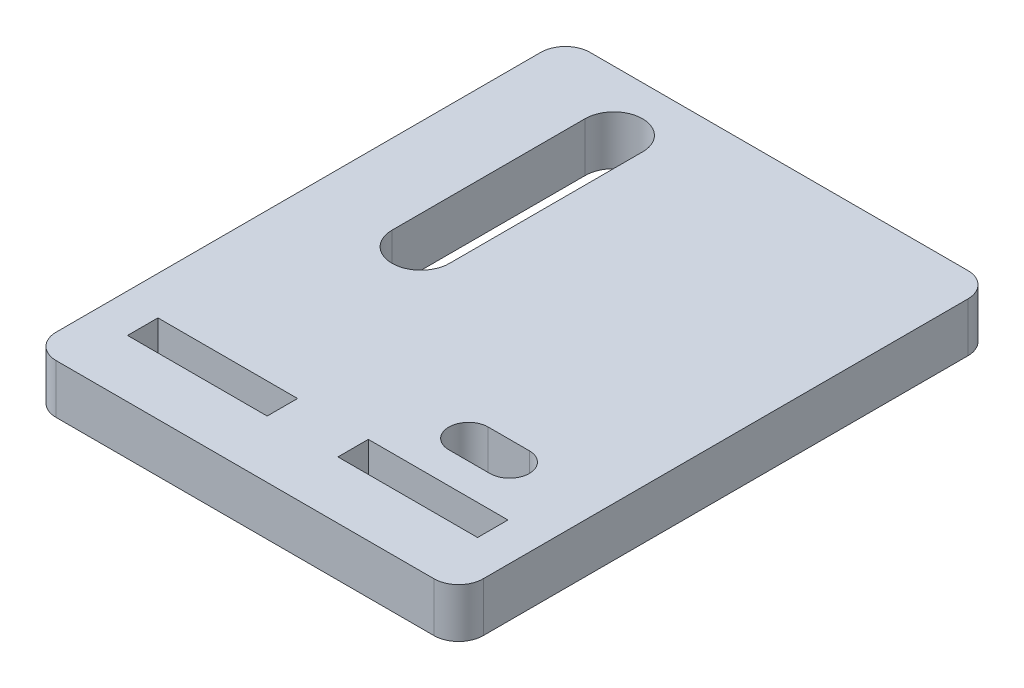
ISO-10303-21;
HEADER;
FILE_DESCRIPTION(('STEP AP214'),'2;1');
FILE_NAME('part.step','',(''),(''),'','','');
FILE_SCHEMA(('AUTOMOTIVE_DESIGN { 1 0 10303 214 1 1 1 1 }'));
ENDSEC;
DATA;
#1=APPLICATION_CONTEXT('core data for automotive mechanical design processes');
#2=APPLICATION_PROTOCOL_DEFINITION('international standard','automotive_design',2000,#1);
#3=PRODUCT_CONTEXT('',#1,'mechanical');
#4=PRODUCT('Part','Part','',(#3));
#5=PRODUCT_RELATED_PRODUCT_CATEGORY('part','',(#4));
#6=PRODUCT_DEFINITION_FORMATION('','',#4);
#7=PRODUCT_DEFINITION_CONTEXT('part definition',#1,'design');
#8=PRODUCT_DEFINITION('design','',#6,#7);
#9=PRODUCT_DEFINITION_SHAPE('','',#8);
#10=(LENGTH_UNIT() NAMED_UNIT(*) SI_UNIT(.MILLI.,.METRE.));
#11=(NAMED_UNIT(*) PLANE_ANGLE_UNIT() SI_UNIT($,.RADIAN.));
#12=(NAMED_UNIT(*) SI_UNIT($,.STERADIAN.) SOLID_ANGLE_UNIT());
#13=UNCERTAINTY_MEASURE_WITH_UNIT(LENGTH_MEASURE(1.E-05),#10,'distance_accuracy_value','');
#14=(GEOMETRIC_REPRESENTATION_CONTEXT(3) GLOBAL_UNCERTAINTY_ASSIGNED_CONTEXT((#13)) GLOBAL_UNIT_ASSIGNED_CONTEXT((#10,
#11,#12)) REPRESENTATION_CONTEXT('',''));
#15=CARTESIAN_POINT('',(0.,0.,0.));
#16=DIRECTION('',(0.,0.,1.));
#17=DIRECTION('',(1.,0.,0.));
#18=AXIS2_PLACEMENT_3D('',#15,#16,#17);
#19=CARTESIAN_POINT('',(0.,6.,0.));
#20=DIRECTION('',(0.,-1.,0.));
#21=DIRECTION('',(0.,0.,-1.));
#22=AXIS2_PLACEMENT_3D('',#19,#20,#21);
#23=PLANE('',#22);
#24=DIRECTION('',(0.,0.,1.));
#25=VECTOR('',#24,1.);
#26=CARTESIAN_POINT('',(-16.3077715235031,6.,-25.2));
#27=LINE('',#26,#25);
#28=CARTESIAN_POINT('',(-16.3077715235031,6.,-25.2));
#29=VERTEX_POINT('',#28);
#30=CARTESIAN_POINT('',(-16.307771523503,6.,-1.7));
#31=VERTEX_POINT('',#30);
#32=EDGE_CURVE('E220',#29,#31,#27,.T.);
#33=ORIENTED_EDGE('',*,*,#32,.F.);
#34=CARTESIAN_POINT('',(-12.8077715235031,6.,-25.2));
#35=DIRECTION('',(0.,1.,0.));
#36=DIRECTION('',(0.,0.,1.));
#37=AXIS2_PLACEMENT_3D('',#34,#35,#36);
#38=CIRCLE('',#37,3.5);
#39=CARTESIAN_POINT('',(-9.30777152350306,6.,-25.2));
#40=VERTEX_POINT('',#39);
#41=EDGE_CURVE('E48',#40,#29,#38,.T.);
#42=ORIENTED_EDGE('',*,*,#41,.F.);
#43=DIRECTION('',(0.,0.,-1.));
#44=VECTOR('',#43,1.);
#45=CARTESIAN_POINT('',(-9.30777152350306,6.,-25.2));
#46=LINE('',#45,#44);
#47=CARTESIAN_POINT('',(-9.30777152350305,6.,-1.7));
#48=VERTEX_POINT('',#47);
#49=EDGE_CURVE('E211',#48,#40,#46,.T.);
#50=ORIENTED_EDGE('',*,*,#49,.F.);
#51=CARTESIAN_POINT('',(-12.8077715235031,6.,-1.7));
#52=DIRECTION('',(0.,1.,0.));
#53=DIRECTION('',(0.,0.,1.));
#54=AXIS2_PLACEMENT_3D('',#51,#52,#53);
#55=CIRCLE('',#54,3.5);
#56=EDGE_CURVE('E214',#31,#48,#55,.T.);
#57=ORIENTED_EDGE('',*,*,#56,.F.);
#58=EDGE_LOOP('',(#33,#42,#50,#57));
#59=FACE_BOUND('',#58,.T.);
#60=DIRECTION('',(1.,0.,0.));
#61=VECTOR('',#60,1.);
#62=CARTESIAN_POINT('',(10.307771523503,6.,18.));
#63=LINE('',#62,#61);
#64=CARTESIAN_POINT('',(10.307771523503,6.,18.));
#65=VERTEX_POINT('',#64);
#66=CARTESIAN_POINT('',(15.3077715235031,6.,18.));
#67=VERTEX_POINT('',#66);
#68=EDGE_CURVE('E245',#65,#67,#63,.T.);
#69=ORIENTED_EDGE('',*,*,#68,.F.);
#70=CARTESIAN_POINT('',(10.307771523503,6.,15.6));
#71=DIRECTION('',(0.,1.,0.));
#72=DIRECTION('',(0.,0.,1.));
#73=AXIS2_PLACEMENT_3D('',#70,#71,#72);
#74=CIRCLE('',#73,2.39999999999999);
#75=CARTESIAN_POINT('',(10.307771523503,6.,13.2));
#76=VERTEX_POINT('',#75);
#77=EDGE_CURVE('E226',#76,#65,#74,.T.);
#78=ORIENTED_EDGE('',*,*,#77,.F.);
#79=DIRECTION('',(-1.,0.,0.));
#80=VECTOR('',#79,1.);
#81=CARTESIAN_POINT('',(10.307771523503,6.,13.2));
#82=LINE('',#81,#80);
#83=CARTESIAN_POINT('',(15.307771523503,6.,13.2));
#84=VERTEX_POINT('',#83);
#85=EDGE_CURVE('E234',#84,#76,#82,.T.);
#86=ORIENTED_EDGE('',*,*,#85,.F.);
#87=CARTESIAN_POINT('',(15.307771523503,6.,15.6));
#88=DIRECTION('',(0.,1.,0.));
#89=DIRECTION('',(0.,0.,1.));
#90=AXIS2_PLACEMENT_3D('',#87,#88,#89);
#91=CIRCLE('',#90,2.39999999999999);
#92=EDGE_CURVE('E248',#67,#84,#91,.T.);
#93=ORIENTED_EDGE('',*,*,#92,.F.);
#94=EDGE_LOOP('',(#69,#78,#86,#93));
#95=FACE_BOUND('',#94,.T.);
#96=DIRECTION('',(-1.,0.,0.));
#97=VECTOR('',#96,1.);
#98=CARTESIAN_POINT('',(-26.,6.,-32.5));
#99=LINE('',#98,#97);
#100=CARTESIAN_POINT('',(23.,6.,-32.5));
#101=VERTEX_POINT('',#100);
#102=CARTESIAN_POINT('',(-23.,6.,-32.5));
#103=VERTEX_POINT('',#102);
#104=EDGE_CURVE('E328',#101,#103,#99,.T.);
#105=ORIENTED_EDGE('',*,*,#104,.T.);
#106=CARTESIAN_POINT('',(-23.,6.,-29.5));
#107=DIRECTION('',(0.,-1.,0.));
#108=DIRECTION('',(0.,0.,-1.));
#109=AXIS2_PLACEMENT_3D('',#106,#107,#108);
#110=CIRCLE('',#109,3.);
#111=CARTESIAN_POINT('',(-26.,6.,-29.5));
#112=VERTEX_POINT('',#111);
#113=EDGE_CURVE('E372',#103,#112,#110,.F.);
#114=ORIENTED_EDGE('',*,*,#113,.T.);
#115=DIRECTION('',(0.,0.,1.));
#116=VECTOR('',#115,1.);
#117=CARTESIAN_POINT('',(-26.,6.,32.5));
#118=LINE('',#117,#116);
#119=CARTESIAN_POINT('',(-26.,6.,29.5));
#120=VERTEX_POINT('',#119);
#121=EDGE_CURVE('E332',#112,#120,#118,.T.);
#122=ORIENTED_EDGE('',*,*,#121,.T.);
#123=CARTESIAN_POINT('',(-23.,6.,29.5));
#124=DIRECTION('',(0.,-1.,0.));
#125=DIRECTION('',(0.,0.,-1.));
#126=AXIS2_PLACEMENT_3D('',#123,#124,#125);
#127=CIRCLE('',#126,3.);
#128=CARTESIAN_POINT('',(-23.,6.,32.5));
#129=VERTEX_POINT('',#128);
#130=EDGE_CURVE('E366',#120,#129,#127,.F.);
#131=ORIENTED_EDGE('',*,*,#130,.T.);
#132=DIRECTION('',(1.,0.,0.));
#133=VECTOR('',#132,1.);
#134=CARTESIAN_POINT('',(-26.,6.,32.5));
#135=LINE('',#134,#133);
#136=CARTESIAN_POINT('',(23.,6.,32.5));
#137=VERTEX_POINT('',#136);
#138=EDGE_CURVE('E335',#129,#137,#135,.T.);
#139=ORIENTED_EDGE('',*,*,#138,.T.);
#140=CARTESIAN_POINT('',(23.,6.,29.5));
#141=DIRECTION('',(0.,-1.,0.));
#142=DIRECTION('',(0.,0.,-1.));
#143=AXIS2_PLACEMENT_3D('',#140,#141,#142);
#144=CIRCLE('',#143,3.);
#145=CARTESIAN_POINT('',(26.,6.,29.5));
#146=VERTEX_POINT('',#145);
#147=EDGE_CURVE('E370',#137,#146,#144,.F.);
#148=ORIENTED_EDGE('',*,*,#147,.T.);
#149=DIRECTION('',(0.,0.,-1.));
#150=VECTOR('',#149,1.);
#151=CARTESIAN_POINT('',(26.,6.,32.5));
#152=LINE('',#151,#150);
#153=CARTESIAN_POINT('',(26.,6.,-29.5));
#154=VERTEX_POINT('',#153);
#155=EDGE_CURVE('E325',#146,#154,#152,.T.);
#156=ORIENTED_EDGE('',*,*,#155,.T.);
#157=CARTESIAN_POINT('',(23.,6.,-29.5));
#158=DIRECTION('',(0.,-1.,0.));
#159=DIRECTION('',(0.,0.,-1.));
#160=AXIS2_PLACEMENT_3D('',#157,#158,#159);
#161=CIRCLE('',#160,3.);
#162=EDGE_CURVE('E368',#154,#101,#161,.F.);
#163=ORIENTED_EDGE('',*,*,#162,.T.);
#164=EDGE_LOOP('',(#105,#114,#122,#131,#139,#148,#156,#163));
#165=FACE_BOUND('',#164,.T.);
#166=DIRECTION('',(-1.,0.,0.));
#167=VECTOR('',#166,1.);
#168=CARTESIAN_POINT('',(-21.307771523503,6.,21.8));
#169=LINE('',#168,#167);
#170=CARTESIAN_POINT('',(-4.30777152350305,6.,21.8));
#171=VERTEX_POINT('',#170);
#172=CARTESIAN_POINT('',(-21.307771523503,6.,21.8));
#173=VERTEX_POINT('',#172);
#174=EDGE_CURVE('E308',#171,#173,#169,.T.);
#175=ORIENTED_EDGE('',*,*,#174,.F.);
#176=DIRECTION('',(0.,0.,-1.));
#177=VECTOR('',#176,1.);
#178=CARTESIAN_POINT('',(-4.30777152350305,6.,25.5));
#179=LINE('',#178,#177);
#180=CARTESIAN_POINT('',(-4.30777152350305,6.,25.5));
#181=VERTEX_POINT('',#180);
#182=EDGE_CURVE('E286',#181,#171,#179,.T.);
#183=ORIENTED_EDGE('',*,*,#182,.F.);
#184=DIRECTION('',(1.,0.,0.));
#185=VECTOR('',#184,1.);
#186=CARTESIAN_POINT('',(-21.307771523503,6.,25.5));
#187=LINE('',#186,#185);
#188=CARTESIAN_POINT('',(-21.307771523503,6.,25.5));
#189=VERTEX_POINT('',#188);
#190=EDGE_CURVE('E297',#189,#181,#187,.T.);
#191=ORIENTED_EDGE('',*,*,#190,.F.);
#192=DIRECTION('',(0.,0.,1.));
#193=VECTOR('',#192,1.);
#194=CARTESIAN_POINT('',(-21.307771523503,6.,25.5));
#195=LINE('',#194,#193);
#196=EDGE_CURVE('E311',#173,#189,#195,.T.);
#197=ORIENTED_EDGE('',*,*,#196,.F.);
#198=EDGE_LOOP('',(#175,#183,#191,#197));
#199=FACE_BOUND('',#198,.T.);
#200=DIRECTION('',(0.,0.,-1.));
#201=VECTOR('',#200,1.);
#202=CARTESIAN_POINT('',(4.30777152350305,6.,25.5));
#203=LINE('',#202,#201);
#204=CARTESIAN_POINT('',(4.30777152350305,6.,25.5));
#205=VERTEX_POINT('',#204);
#206=CARTESIAN_POINT('',(4.30777152350305,6.,21.8));
#207=VERTEX_POINT('',#206);
#208=EDGE_CURVE('E255',#205,#207,#203,.T.);
#209=ORIENTED_EDGE('',*,*,#208,.T.);
#210=DIRECTION('',(1.,0.,0.));
#211=VECTOR('',#210,1.);
#212=CARTESIAN_POINT('',(21.307771523503,6.,21.8));
#213=LINE('',#212,#211);
#214=CARTESIAN_POINT('',(21.307771523503,6.,21.8));
#215=VERTEX_POINT('',#214);
#216=EDGE_CURVE('E265',#207,#215,#213,.T.);
#217=ORIENTED_EDGE('',*,*,#216,.T.);
#218=DIRECTION('',(0.,0.,1.));
#219=VECTOR('',#218,1.);
#220=CARTESIAN_POINT('',(21.307771523503,6.,25.5));
#221=LINE('',#220,#219);
#222=CARTESIAN_POINT('',(21.307771523503,6.,25.5));
#223=VERTEX_POINT('',#222);
#224=EDGE_CURVE('E278',#215,#223,#221,.T.);
#225=ORIENTED_EDGE('',*,*,#224,.T.);
#226=DIRECTION('',(-1.,0.,0.));
#227=VECTOR('',#226,1.);
#228=CARTESIAN_POINT('',(21.307771523503,6.,25.5));
#229=LINE('',#228,#227);
#230=EDGE_CURVE('E275',#223,#205,#229,.T.);
#231=ORIENTED_EDGE('',*,*,#230,.T.);
#232=EDGE_LOOP('',(#209,#217,#225,#231));
#233=FACE_BOUND('',#232,.T.);
#234=ADVANCED_FACE('F33',(#59,#95,#165,#199,#233),#23,.F.);
#235=CARTESIAN_POINT('',(0.,0.,0.));
#236=DIRECTION('',(0.,-1.,0.));
#237=DIRECTION('',(0.,0.,-1.));
#238=AXIS2_PLACEMENT_3D('',#235,#236,#237);
#239=PLANE('',#238);
#240=CARTESIAN_POINT('',(-12.8077715235031,0.,-25.2));
#241=DIRECTION('',(0.,1.,0.));
#242=DIRECTION('',(0.,0.,1.));
#243=AXIS2_PLACEMENT_3D('',#240,#241,#242);
#244=CIRCLE('',#243,3.5);
#245=CARTESIAN_POINT('',(-9.30777152350306,0.,-25.2));
#246=VERTEX_POINT('',#245);
#247=CARTESIAN_POINT('',(-16.3077715235031,0.,-25.2));
#248=VERTEX_POINT('',#247);
#249=EDGE_CURVE('E195',#246,#248,#244,.T.);
#250=ORIENTED_EDGE('',*,*,#249,.T.);
#251=DIRECTION('',(0.,0.,1.));
#252=VECTOR('',#251,1.);
#253=CARTESIAN_POINT('',(-16.3077715235031,0.,-25.2));
#254=LINE('',#253,#252);
#255=CARTESIAN_POINT('',(-16.307771523503,0.,-1.7));
#256=VERTEX_POINT('',#255);
#257=EDGE_CURVE('E204',#248,#256,#254,.T.);
#258=ORIENTED_EDGE('',*,*,#257,.T.);
#259=CARTESIAN_POINT('',(-12.8077715235031,0.,-1.7));
#260=DIRECTION('',(0.,1.,0.));
#261=DIRECTION('',(0.,0.,1.));
#262=AXIS2_PLACEMENT_3D('',#259,#260,#261);
#263=CIRCLE('',#262,3.5);
#264=CARTESIAN_POINT('',(-9.30777152350305,0.,-1.7));
#265=VERTEX_POINT('',#264);
#266=EDGE_CURVE('E56',#256,#265,#263,.T.);
#267=ORIENTED_EDGE('',*,*,#266,.T.);
#268=DIRECTION('',(0.,0.,-1.));
#269=VECTOR('',#268,1.);
#270=CARTESIAN_POINT('',(-9.30777152350306,0.,-25.2));
#271=LINE('',#270,#269);
#272=EDGE_CURVE('E201',#265,#246,#271,.T.);
#273=ORIENTED_EDGE('',*,*,#272,.T.);
#274=EDGE_LOOP('',(#250,#258,#267,#273));
#275=FACE_BOUND('',#274,.T.);
#276=CARTESIAN_POINT('',(10.307771523503,0.,15.6));
#277=DIRECTION('',(0.,1.,0.));
#278=DIRECTION('',(0.,0.,1.));
#279=AXIS2_PLACEMENT_3D('',#276,#277,#278);
#280=CIRCLE('',#279,2.39999999999999);
#281=CARTESIAN_POINT('',(10.307771523503,0.,13.2));
#282=VERTEX_POINT('',#281);
#283=CARTESIAN_POINT('',(10.307771523503,0.,18.));
#284=VERTEX_POINT('',#283);
#285=EDGE_CURVE('E230',#282,#284,#280,.T.);
#286=ORIENTED_EDGE('',*,*,#285,.T.);
#287=DIRECTION('',(1.,0.,0.));
#288=VECTOR('',#287,1.);
#289=CARTESIAN_POINT('',(10.307771523503,0.,18.));
#290=LINE('',#289,#288);
#291=CARTESIAN_POINT('',(15.3077715235031,0.,18.));
#292=VERTEX_POINT('',#291);
#293=EDGE_CURVE('E233',#284,#292,#290,.T.);
#294=ORIENTED_EDGE('',*,*,#293,.T.);
#295=CARTESIAN_POINT('',(15.307771523503,0.,15.6));
#296=DIRECTION('',(0.,1.,0.));
#297=DIRECTION('',(0.,0.,1.));
#298=AXIS2_PLACEMENT_3D('',#295,#296,#297);
#299=CIRCLE('',#298,2.39999999999999);
#300=CARTESIAN_POINT('',(15.307771523503,0.,13.2));
#301=VERTEX_POINT('',#300);
#302=EDGE_CURVE('E237',#292,#301,#299,.T.);
#303=ORIENTED_EDGE('',*,*,#302,.T.);
#304=DIRECTION('',(-1.,0.,0.));
#305=VECTOR('',#304,1.);
#306=CARTESIAN_POINT('',(10.307771523503,0.,13.2));
#307=LINE('',#306,#305);
#308=EDGE_CURVE('E240',#301,#282,#307,.T.);
#309=ORIENTED_EDGE('',*,*,#308,.T.);
#310=EDGE_LOOP('',(#286,#294,#303,#309));
#311=FACE_BOUND('',#310,.T.);
#312=DIRECTION('',(0.,0.,-1.));
#313=VECTOR('',#312,1.);
#314=CARTESIAN_POINT('',(-4.30777152350305,0.,25.5));
#315=LINE('',#314,#313);
#316=CARTESIAN_POINT('',(-4.30777152350305,0.,25.5));
#317=VERTEX_POINT('',#316);
#318=CARTESIAN_POINT('',(-4.30777152350305,0.,21.8));
#319=VERTEX_POINT('',#318);
#320=EDGE_CURVE('E293',#317,#319,#315,.T.);
#321=ORIENTED_EDGE('',*,*,#320,.T.);
#322=DIRECTION('',(-1.,0.,0.));
#323=VECTOR('',#322,1.);
#324=CARTESIAN_POINT('',(-21.307771523503,0.,21.8));
#325=LINE('',#324,#323);
#326=CARTESIAN_POINT('',(-21.307771523503,0.,21.8));
#327=VERTEX_POINT('',#326);
#328=EDGE_CURVE('E296',#319,#327,#325,.T.);
#329=ORIENTED_EDGE('',*,*,#328,.T.);
#330=DIRECTION('',(0.,0.,1.));
#331=VECTOR('',#330,1.);
#332=CARTESIAN_POINT('',(-21.307771523503,0.,25.5));
#333=LINE('',#332,#331);
#334=CARTESIAN_POINT('',(-21.307771523503,0.,25.5));
#335=VERTEX_POINT('',#334);
#336=EDGE_CURVE('E300',#327,#335,#333,.T.);
#337=ORIENTED_EDGE('',*,*,#336,.T.);
#338=DIRECTION('',(1.,0.,0.));
#339=VECTOR('',#338,1.);
#340=CARTESIAN_POINT('',(-21.307771523503,0.,25.5));
#341=LINE('',#340,#339);
#342=EDGE_CURVE('E303',#335,#317,#341,.T.);
#343=ORIENTED_EDGE('',*,*,#342,.T.);
#344=EDGE_LOOP('',(#321,#329,#337,#343));
#345=FACE_BOUND('',#344,.T.);
#346=DIRECTION('',(0.,0.,1.));
#347=VECTOR('',#346,1.);
#348=CARTESIAN_POINT('',(-26.,0.,32.5));
#349=LINE('',#348,#347);
#350=CARTESIAN_POINT('',(-26.,0.,-29.5));
#351=VERTEX_POINT('',#350);
#352=CARTESIAN_POINT('',(-26.,0.,29.5));
#353=VERTEX_POINT('',#352);
#354=EDGE_CURVE('E344',#351,#353,#349,.T.);
#355=ORIENTED_EDGE('',*,*,#354,.F.);
#356=CARTESIAN_POINT('',(-23.,0.,-29.5));
#357=DIRECTION('',(0.,-1.,0.));
#358=DIRECTION('',(0.,0.,-1.));
#359=AXIS2_PLACEMENT_3D('',#356,#357,#358);
#360=CIRCLE('',#359,3.);
#361=CARTESIAN_POINT('',(-23.,0.,-32.5));
#362=VERTEX_POINT('',#361);
#363=EDGE_CURVE('E359',#351,#362,#360,.T.);
#364=ORIENTED_EDGE('',*,*,#363,.T.);
#365=DIRECTION('',(-1.,0.,0.));
#366=VECTOR('',#365,1.);
#367=CARTESIAN_POINT('',(-26.,0.,-32.5));
#368=LINE('',#367,#366);
#369=CARTESIAN_POINT('',(23.,0.,-32.5));
#370=VERTEX_POINT('',#369);
#371=EDGE_CURVE('E341',#370,#362,#368,.T.);
#372=ORIENTED_EDGE('',*,*,#371,.F.);
#373=CARTESIAN_POINT('',(23.,0.,-29.5));
#374=DIRECTION('',(0.,-1.,0.));
#375=DIRECTION('',(0.,0.,-1.));
#376=AXIS2_PLACEMENT_3D('',#373,#374,#375);
#377=CIRCLE('',#376,3.);
#378=CARTESIAN_POINT('',(26.,0.,-29.5));
#379=VERTEX_POINT('',#378);
#380=EDGE_CURVE('E355',#370,#379,#377,.T.);
#381=ORIENTED_EDGE('',*,*,#380,.T.);
#382=DIRECTION('',(0.,0.,-1.));
#383=VECTOR('',#382,1.);
#384=CARTESIAN_POINT('',(26.,0.,32.5));
#385=LINE('',#384,#383);
#386=CARTESIAN_POINT('',(26.,0.,29.5));
#387=VERTEX_POINT('',#386);
#388=EDGE_CURVE('E318',#387,#379,#385,.T.);
#389=ORIENTED_EDGE('',*,*,#388,.F.);
#390=CARTESIAN_POINT('',(23.,0.,29.5));
#391=DIRECTION('',(0.,-1.,0.));
#392=DIRECTION('',(0.,0.,-1.));
#393=AXIS2_PLACEMENT_3D('',#390,#391,#392);
#394=CIRCLE('',#393,3.);
#395=CARTESIAN_POINT('',(23.,0.,32.5));
#396=VERTEX_POINT('',#395);
#397=EDGE_CURVE('E357',#387,#396,#394,.T.);
#398=ORIENTED_EDGE('',*,*,#397,.T.);
#399=DIRECTION('',(1.,0.,0.));
#400=VECTOR('',#399,1.);
#401=CARTESIAN_POINT('',(-26.,0.,32.5));
#402=LINE('',#401,#400);
#403=CARTESIAN_POINT('',(-23.,0.,32.5));
#404=VERTEX_POINT('',#403);
#405=EDGE_CURVE('E329',#404,#396,#402,.T.);
#406=ORIENTED_EDGE('',*,*,#405,.F.);
#407=CARTESIAN_POINT('',(-23.,0.,29.5));
#408=DIRECTION('',(0.,-1.,0.));
#409=DIRECTION('',(0.,0.,-1.));
#410=AXIS2_PLACEMENT_3D('',#407,#408,#409);
#411=CIRCLE('',#410,3.);
#412=EDGE_CURVE('E353',#404,#353,#411,.T.);
#413=ORIENTED_EDGE('',*,*,#412,.T.);
#414=EDGE_LOOP('',(#355,#364,#372,#381,#389,#398,#406,#413));
#415=FACE_BOUND('',#414,.T.);
#416=DIRECTION('',(1.,0.,0.));
#417=VECTOR('',#416,1.);
#418=CARTESIAN_POINT('',(21.307771523503,0.,21.8));
#419=LINE('',#418,#417);
#420=CARTESIAN_POINT('',(4.30777152350305,0.,21.8));
#421=VERTEX_POINT('',#420);
#422=CARTESIAN_POINT('',(21.307771523503,0.,21.8));
#423=VERTEX_POINT('',#422);
#424=EDGE_CURVE('E270',#421,#423,#419,.T.);
#425=ORIENTED_EDGE('',*,*,#424,.F.);
#426=DIRECTION('',(0.,0.,-1.));
#427=VECTOR('',#426,1.);
#428=CARTESIAN_POINT('',(4.30777152350305,0.,25.5));
#429=LINE('',#428,#427);
#430=CARTESIAN_POINT('',(4.30777152350305,0.,25.5));
#431=VERTEX_POINT('',#430);
#432=EDGE_CURVE('E262',#431,#421,#429,.T.);
#433=ORIENTED_EDGE('',*,*,#432,.F.);
#434=DIRECTION('',(-1.,0.,0.));
#435=VECTOR('',#434,1.);
#436=CARTESIAN_POINT('',(21.307771523503,0.,25.5));
#437=LINE('',#436,#435);
#438=CARTESIAN_POINT('',(21.307771523503,0.,25.5));
#439=VERTEX_POINT('',#438);
#440=EDGE_CURVE('E264',#439,#431,#437,.T.);
#441=ORIENTED_EDGE('',*,*,#440,.F.);
#442=DIRECTION('',(0.,0.,1.));
#443=VECTOR('',#442,1.);
#444=CARTESIAN_POINT('',(21.307771523503,0.,25.5));
#445=LINE('',#444,#443);
#446=EDGE_CURVE('E267',#423,#439,#445,.T.);
#447=ORIENTED_EDGE('',*,*,#446,.F.);
#448=EDGE_LOOP('',(#425,#433,#441,#447));
#449=FACE_BOUND('',#448,.T.);
#450=ADVANCED_FACE('F208',(#275,#311,#345,#415,#449),#239,.T.);
#451=CARTESIAN_POINT('',(26.,6.,32.5));
#452=DIRECTION('',(-1.,0.,0.));
#453=DIRECTION('',(0.,0.,1.));
#454=AXIS2_PLACEMENT_3D('',#451,#452,#453);
#455=PLANE('',#454);
#456=ORIENTED_EDGE('',*,*,#155,.F.);
#457=DIRECTION('',(0.,-1.,0.));
#458=VECTOR('',#457,1.);
#459=CARTESIAN_POINT('',(26.,6.,29.5));
#460=LINE('',#459,#458);
#461=EDGE_CURVE('E376',#146,#387,#460,.T.);
#462=ORIENTED_EDGE('',*,*,#461,.T.);
#463=ORIENTED_EDGE('',*,*,#388,.T.);
#464=DIRECTION('',(0.,-1.,0.));
#465=VECTOR('',#464,1.);
#466=CARTESIAN_POINT('',(26.,6.,-29.5));
#467=LINE('',#466,#465);
#468=EDGE_CURVE('E374',#379,#154,#467,.F.);
#469=ORIENTED_EDGE('',*,*,#468,.T.);
#470=EDGE_LOOP('',(#456,#462,#463,#469));
#471=FACE_BOUND('',#470,.T.);
#472=ADVANCED_FACE('F397',(#471),#455,.F.);
#473=CARTESIAN_POINT('',(-26.,6.,-32.5));
#474=DIRECTION('',(0.,0.,1.));
#475=DIRECTION('',(1.,0.,0.));
#476=AXIS2_PLACEMENT_3D('',#473,#474,#475);
#477=PLANE('',#476);
#478=ORIENTED_EDGE('',*,*,#371,.T.);
#479=DIRECTION('',(0.,-1.,0.));
#480=VECTOR('',#479,1.);
#481=CARTESIAN_POINT('',(-23.,6.,-32.5));
#482=LINE('',#481,#480);
#483=EDGE_CURVE('E364',#362,#103,#482,.F.);
#484=ORIENTED_EDGE('',*,*,#483,.T.);
#485=ORIENTED_EDGE('',*,*,#104,.F.);
#486=DIRECTION('',(0.,-1.,0.));
#487=VECTOR('',#486,1.);
#488=CARTESIAN_POINT('',(23.,6.,-32.5));
#489=LINE('',#488,#487);
#490=EDGE_CURVE('E361',#101,#370,#489,.T.);
#491=ORIENTED_EDGE('',*,*,#490,.T.);
#492=EDGE_LOOP('',(#478,#484,#485,#491));
#493=FACE_BOUND('',#492,.T.);
#494=ADVANCED_FACE('F408',(#493),#477,.F.);
#495=CARTESIAN_POINT('',(-26.,6.,32.5));
#496=DIRECTION('',(1.,0.,0.));
#497=DIRECTION('',(0.,0.,-1.));
#498=AXIS2_PLACEMENT_3D('',#495,#496,#497);
#499=PLANE('',#498);
#500=ORIENTED_EDGE('',*,*,#121,.F.);
#501=DIRECTION('',(0.,-1.,0.));
#502=VECTOR('',#501,1.);
#503=CARTESIAN_POINT('',(-26.,6.,-29.5));
#504=LINE('',#503,#502);
#505=EDGE_CURVE('E350',#112,#351,#504,.T.);
#506=ORIENTED_EDGE('',*,*,#505,.T.);
#507=ORIENTED_EDGE('',*,*,#354,.T.);
#508=DIRECTION('',(0.,-1.,0.));
#509=VECTOR('',#508,1.);
#510=CARTESIAN_POINT('',(-26.,6.,29.5));
#511=LINE('',#510,#509);
#512=EDGE_CURVE('E338',#353,#120,#511,.F.);
#513=ORIENTED_EDGE('',*,*,#512,.T.);
#514=EDGE_LOOP('',(#500,#506,#507,#513));
#515=FACE_BOUND('',#514,.T.);
#516=ADVANCED_FACE('F416',(#515),#499,.F.);
#517=CARTESIAN_POINT('',(-26.,6.,32.5));
#518=DIRECTION('',(0.,0.,-1.));
#519=DIRECTION('',(-1.,0.,0.));
#520=AXIS2_PLACEMENT_3D('',#517,#518,#519);
#521=PLANE('',#520);
#522=ORIENTED_EDGE('',*,*,#405,.T.);
#523=DIRECTION('',(0.,-1.,0.));
#524=VECTOR('',#523,1.);
#525=CARTESIAN_POINT('',(23.,6.,32.5));
#526=LINE('',#525,#524);
#527=EDGE_CURVE('E11',#396,#137,#526,.F.);
#528=ORIENTED_EDGE('',*,*,#527,.T.);
#529=ORIENTED_EDGE('',*,*,#138,.F.);
#530=DIRECTION('',(0.,-1.,0.));
#531=VECTOR('',#530,1.);
#532=CARTESIAN_POINT('',(-23.,6.,32.5));
#533=LINE('',#532,#531);
#534=EDGE_CURVE('E41',#129,#404,#533,.T.);
#535=ORIENTED_EDGE('',*,*,#534,.T.);
#536=EDGE_LOOP('',(#522,#528,#529,#535));
#537=FACE_BOUND('',#536,.T.);
#538=ADVANCED_FACE('F383',(#537),#521,.F.);
#539=CARTESIAN_POINT('',(-23.,6.,-29.5));
#540=DIRECTION('',(0.,-1.,0.));
#541=DIRECTION('',(0.,0.,-1.));
#542=AXIS2_PLACEMENT_3D('',#539,#540,#541);
#543=CYLINDRICAL_SURFACE('',#542,3.);
#544=ORIENTED_EDGE('',*,*,#113,.F.);
#545=ORIENTED_EDGE('',*,*,#483,.F.);
#546=ORIENTED_EDGE('',*,*,#363,.F.);
#547=ORIENTED_EDGE('',*,*,#505,.F.);
#548=EDGE_LOOP('',(#544,#545,#546,#547));
#549=FACE_BOUND('',#548,.T.);
#550=ADVANCED_FACE('F413',(#549),#543,.T.);
#551=CARTESIAN_POINT('',(23.,6.,29.5));
#552=DIRECTION('',(0.,-1.,0.));
#553=DIRECTION('',(0.,0.,-1.));
#554=AXIS2_PLACEMENT_3D('',#551,#552,#553);
#555=CYLINDRICAL_SURFACE('',#554,3.);
#556=ORIENTED_EDGE('',*,*,#147,.F.);
#557=ORIENTED_EDGE('',*,*,#527,.F.);
#558=ORIENTED_EDGE('',*,*,#397,.F.);
#559=ORIENTED_EDGE('',*,*,#461,.F.);
#560=EDGE_LOOP('',(#556,#557,#558,#559));
#561=FACE_BOUND('',#560,.T.);
#562=ADVANCED_FACE('F394',(#561),#555,.T.);
#563=CARTESIAN_POINT('',(23.,6.,-29.5));
#564=DIRECTION('',(0.,-1.,0.));
#565=DIRECTION('',(0.,0.,-1.));
#566=AXIS2_PLACEMENT_3D('',#563,#564,#565);
#567=CYLINDRICAL_SURFACE('',#566,3.);
#568=ORIENTED_EDGE('',*,*,#162,.F.);
#569=ORIENTED_EDGE('',*,*,#468,.F.);
#570=ORIENTED_EDGE('',*,*,#380,.F.);
#571=ORIENTED_EDGE('',*,*,#490,.F.);
#572=EDGE_LOOP('',(#568,#569,#570,#571));
#573=FACE_BOUND('',#572,.T.);
#574=ADVANCED_FACE('F405',(#573),#567,.T.);
#575=CARTESIAN_POINT('',(-23.,6.,29.5));
#576=DIRECTION('',(0.,-1.,0.));
#577=DIRECTION('',(0.,0.,-1.));
#578=AXIS2_PLACEMENT_3D('',#575,#576,#577);
#579=CYLINDRICAL_SURFACE('',#578,3.);
#580=ORIENTED_EDGE('',*,*,#130,.F.);
#581=ORIENTED_EDGE('',*,*,#512,.F.);
#582=ORIENTED_EDGE('',*,*,#412,.F.);
#583=ORIENTED_EDGE('',*,*,#534,.F.);
#584=EDGE_LOOP('',(#580,#581,#582,#583));
#585=FACE_BOUND('',#584,.T.);
#586=ADVANCED_FACE('F35',(#585),#579,.T.);
#587=CARTESIAN_POINT('',(-4.30777152350305,0.,25.5));
#588=DIRECTION('',(1.,0.,0.));
#589=DIRECTION('',(0.,0.,-1.));
#590=AXIS2_PLACEMENT_3D('',#587,#588,#589);
#591=PLANE('',#590);
#592=ORIENTED_EDGE('',*,*,#182,.T.);
#593=DIRECTION('',(0.,1.,0.));
#594=VECTOR('',#593,1.);
#595=CARTESIAN_POINT('',(-4.30777152350305,0.,21.8));
#596=LINE('',#595,#594);
#597=EDGE_CURVE('E306',#319,#171,#596,.T.);
#598=ORIENTED_EDGE('',*,*,#597,.F.);
#599=ORIENTED_EDGE('',*,*,#320,.F.);
#600=DIRECTION('',(0.,1.,0.));
#601=VECTOR('',#600,1.);
#602=CARTESIAN_POINT('',(-4.30777152350305,0.,25.5));
#603=LINE('',#602,#601);
#604=EDGE_CURVE('E316',#317,#181,#603,.T.);
#605=ORIENTED_EDGE('',*,*,#604,.T.);
#606=EDGE_LOOP('',(#592,#598,#599,#605));
#607=FACE_BOUND('',#606,.T.);
#608=ADVANCED_FACE('F419',(#607),#591,.F.);
#609=CARTESIAN_POINT('',(-21.307771523503,0.,25.5));
#610=DIRECTION('',(0.,0.,1.));
#611=DIRECTION('',(1.,0.,0.));
#612=AXIS2_PLACEMENT_3D('',#609,#610,#611);
#613=PLANE('',#612);
#614=ORIENTED_EDGE('',*,*,#190,.T.);
#615=ORIENTED_EDGE('',*,*,#604,.F.);
#616=ORIENTED_EDGE('',*,*,#342,.F.);
#617=DIRECTION('',(0.,1.,0.));
#618=VECTOR('',#617,1.);
#619=CARTESIAN_POINT('',(-21.307771523503,0.,25.5));
#620=LINE('',#619,#618);
#621=EDGE_CURVE('E319',#335,#189,#620,.T.);
#622=ORIENTED_EDGE('',*,*,#621,.T.);
#623=EDGE_LOOP('',(#614,#615,#616,#622));
#624=FACE_BOUND('',#623,.T.);
#625=ADVANCED_FACE('F424',(#624),#613,.F.);
#626=CARTESIAN_POINT('',(-21.307771523503,0.,25.5));
#627=DIRECTION('',(-1.,0.,0.));
#628=DIRECTION('',(0.,0.,1.));
#629=AXIS2_PLACEMENT_3D('',#626,#627,#628);
#630=PLANE('',#629);
#631=ORIENTED_EDGE('',*,*,#196,.T.);
#632=ORIENTED_EDGE('',*,*,#621,.F.);
#633=ORIENTED_EDGE('',*,*,#336,.F.);
#634=DIRECTION('',(0.,1.,0.));
#635=VECTOR('',#634,1.);
#636=CARTESIAN_POINT('',(-21.307771523503,0.,21.8));
#637=LINE('',#636,#635);
#638=EDGE_CURVE('E321',#327,#173,#637,.T.);
#639=ORIENTED_EDGE('',*,*,#638,.T.);
#640=EDGE_LOOP('',(#631,#632,#633,#639));
#641=FACE_BOUND('',#640,.T.);
#642=ADVANCED_FACE('F475',(#641),#630,.F.);
#643=CARTESIAN_POINT('',(-21.307771523503,0.,21.8));
#644=DIRECTION('',(0.,0.,-1.));
#645=DIRECTION('',(-1.,0.,0.));
#646=AXIS2_PLACEMENT_3D('',#643,#644,#645);
#647=PLANE('',#646);
#648=ORIENTED_EDGE('',*,*,#174,.T.);
#649=ORIENTED_EDGE('',*,*,#638,.F.);
#650=ORIENTED_EDGE('',*,*,#328,.F.);
#651=ORIENTED_EDGE('',*,*,#597,.T.);
#652=EDGE_LOOP('',(#648,#649,#650,#651));
#653=FACE_BOUND('',#652,.T.);
#654=ADVANCED_FACE('F485',(#653),#647,.F.);
#655=CARTESIAN_POINT('',(4.30777152350305,0.,25.5));
#656=DIRECTION('',(1.,0.,0.));
#657=DIRECTION('',(0.,0.,-1.));
#658=AXIS2_PLACEMENT_3D('',#655,#656,#657);
#659=PLANE('',#658);
#660=ORIENTED_EDGE('',*,*,#208,.F.);
#661=DIRECTION('',(0.,1.,0.));
#662=VECTOR('',#661,1.);
#663=CARTESIAN_POINT('',(4.30777152350305,0.,25.5));
#664=LINE('',#663,#662);
#665=EDGE_CURVE('E272',#431,#205,#664,.T.);
#666=ORIENTED_EDGE('',*,*,#665,.F.);
#667=ORIENTED_EDGE('',*,*,#432,.T.);
#668=DIRECTION('',(0.,1.,0.));
#669=VECTOR('',#668,1.);
#670=CARTESIAN_POINT('',(4.30777152350305,0.,21.8));
#671=LINE('',#670,#669);
#672=EDGE_CURVE('E283',#421,#207,#671,.T.);
#673=ORIENTED_EDGE('',*,*,#672,.T.);
#674=EDGE_LOOP('',(#660,#666,#667,#673));
#675=FACE_BOUND('',#674,.T.);
#676=ADVANCED_FACE('F495',(#675),#659,.T.);
#677=CARTESIAN_POINT('',(21.307771523503,0.,21.8));
#678=DIRECTION('',(0.,0.,1.));
#679=DIRECTION('',(1.,0.,0.));
#680=AXIS2_PLACEMENT_3D('',#677,#678,#679);
#681=PLANE('',#680);
#682=ORIENTED_EDGE('',*,*,#216,.F.);
#683=ORIENTED_EDGE('',*,*,#672,.F.);
#684=ORIENTED_EDGE('',*,*,#424,.T.);
#685=DIRECTION('',(0.,1.,0.));
#686=VECTOR('',#685,1.);
#687=CARTESIAN_POINT('',(21.307771523503,0.,21.8));
#688=LINE('',#687,#686);
#689=EDGE_CURVE('E287',#423,#215,#688,.T.);
#690=ORIENTED_EDGE('',*,*,#689,.T.);
#691=EDGE_LOOP('',(#682,#683,#684,#690));
#692=FACE_BOUND('',#691,.T.);
#693=ADVANCED_FACE('F505',(#692),#681,.T.);
#694=CARTESIAN_POINT('',(21.307771523503,0.,25.5));
#695=DIRECTION('',(-1.,0.,0.));
#696=DIRECTION('',(0.,0.,1.));
#697=AXIS2_PLACEMENT_3D('',#694,#695,#696);
#698=PLANE('',#697);
#699=ORIENTED_EDGE('',*,*,#224,.F.);
#700=ORIENTED_EDGE('',*,*,#689,.F.);
#701=ORIENTED_EDGE('',*,*,#446,.T.);
#702=DIRECTION('',(0.,1.,0.));
#703=VECTOR('',#702,1.);
#704=CARTESIAN_POINT('',(21.307771523503,0.,25.5));
#705=LINE('',#704,#703);
#706=EDGE_CURVE('E289',#439,#223,#705,.T.);
#707=ORIENTED_EDGE('',*,*,#706,.T.);
#708=EDGE_LOOP('',(#699,#700,#701,#707));
#709=FACE_BOUND('',#708,.T.);
#710=ADVANCED_FACE('F516',(#709),#698,.T.);
#711=CARTESIAN_POINT('',(21.307771523503,0.,25.5));
#712=DIRECTION('',(0.,0.,-1.));
#713=DIRECTION('',(-1.,0.,0.));
#714=AXIS2_PLACEMENT_3D('',#711,#712,#713);
#715=PLANE('',#714);
#716=ORIENTED_EDGE('',*,*,#230,.F.);
#717=ORIENTED_EDGE('',*,*,#706,.F.);
#718=ORIENTED_EDGE('',*,*,#440,.T.);
#719=ORIENTED_EDGE('',*,*,#665,.T.);
#720=EDGE_LOOP('',(#716,#717,#718,#719));
#721=FACE_BOUND('',#720,.T.);
#722=ADVANCED_FACE('F526',(#721),#715,.T.);
#723=CARTESIAN_POINT('',(10.307771523503,0.,15.6));
#724=DIRECTION('',(0.,1.,0.));
#725=DIRECTION('',(0.,0.,1.));
#726=AXIS2_PLACEMENT_3D('',#723,#724,#725);
#727=CYLINDRICAL_SURFACE('',#726,2.39999999999999);
#728=ORIENTED_EDGE('',*,*,#77,.T.);
#729=DIRECTION('',(0.,1.,0.));
#730=VECTOR('',#729,1.);
#731=CARTESIAN_POINT('',(10.307771523503,0.,18.));
#732=LINE('',#731,#730);
#733=EDGE_CURVE('E243',#284,#65,#732,.T.);
#734=ORIENTED_EDGE('',*,*,#733,.F.);
#735=ORIENTED_EDGE('',*,*,#285,.F.);
#736=DIRECTION('',(0.,1.,0.));
#737=VECTOR('',#736,1.);
#738=CARTESIAN_POINT('',(10.307771523503,0.,13.2));
#739=LINE('',#738,#737);
#740=EDGE_CURVE('E253',#282,#76,#739,.T.);
#741=ORIENTED_EDGE('',*,*,#740,.T.);
#742=EDGE_LOOP('',(#728,#734,#735,#741));
#743=FACE_BOUND('',#742,.T.);
#744=ADVANCED_FACE('F536',(#743),#727,.F.);
#745=CARTESIAN_POINT('',(10.307771523503,0.,13.2));
#746=DIRECTION('',(0.,0.,-1.));
#747=DIRECTION('',(-1.,0.,0.));
#748=AXIS2_PLACEMENT_3D('',#745,#746,#747);
#749=PLANE('',#748);
#750=ORIENTED_EDGE('',*,*,#85,.T.);
#751=ORIENTED_EDGE('',*,*,#740,.F.);
#752=ORIENTED_EDGE('',*,*,#308,.F.);
#753=DIRECTION('',(0.,1.,0.));
#754=VECTOR('',#753,1.);
#755=CARTESIAN_POINT('',(15.307771523503,0.,13.2));
#756=LINE('',#755,#754);
#757=EDGE_CURVE('E256',#301,#84,#756,.T.);
#758=ORIENTED_EDGE('',*,*,#757,.T.);
#759=EDGE_LOOP('',(#750,#751,#752,#758));
#760=FACE_BOUND('',#759,.T.);
#761=ADVANCED_FACE('F546',(#760),#749,.F.);
#762=CARTESIAN_POINT('',(15.307771523503,0.,15.6));
#763=DIRECTION('',(0.,1.,0.));
#764=DIRECTION('',(0.,0.,1.));
#765=AXIS2_PLACEMENT_3D('',#762,#763,#764);
#766=CYLINDRICAL_SURFACE('',#765,2.39999999999999);
#767=ORIENTED_EDGE('',*,*,#92,.T.);
#768=ORIENTED_EDGE('',*,*,#757,.F.);
#769=ORIENTED_EDGE('',*,*,#302,.F.);
#770=DIRECTION('',(0.,1.,0.));
#771=VECTOR('',#770,1.);
#772=CARTESIAN_POINT('',(15.3077715235031,0.,18.));
#773=LINE('',#772,#771);
#774=EDGE_CURVE('E258',#292,#67,#773,.T.);
#775=ORIENTED_EDGE('',*,*,#774,.T.);
#776=EDGE_LOOP('',(#767,#768,#769,#775));
#777=FACE_BOUND('',#776,.T.);
#778=ADVANCED_FACE('F556',(#777),#766,.F.);
#779=CARTESIAN_POINT('',(10.307771523503,0.,18.));
#780=DIRECTION('',(0.,0.,1.));
#781=DIRECTION('',(1.,0.,0.));
#782=AXIS2_PLACEMENT_3D('',#779,#780,#781);
#783=PLANE('',#782);
#784=ORIENTED_EDGE('',*,*,#68,.T.);
#785=ORIENTED_EDGE('',*,*,#774,.F.);
#786=ORIENTED_EDGE('',*,*,#293,.F.);
#787=ORIENTED_EDGE('',*,*,#733,.T.);
#788=EDGE_LOOP('',(#784,#785,#786,#787));
#789=FACE_BOUND('',#788,.T.);
#790=ADVANCED_FACE('F566',(#789),#783,.F.);
#791=CARTESIAN_POINT('',(-12.8077715235031,0.,-25.2));
#792=DIRECTION('',(0.,1.,0.));
#793=DIRECTION('',(0.,0.,1.));
#794=AXIS2_PLACEMENT_3D('',#791,#792,#793);
#795=CYLINDRICAL_SURFACE('',#794,3.5);
#796=ORIENTED_EDGE('',*,*,#41,.T.);
#797=DIRECTION('',(0.,1.,0.));
#798=VECTOR('',#797,1.);
#799=CARTESIAN_POINT('',(-16.3077715235031,0.,-25.2));
#800=LINE('',#799,#798);
#801=EDGE_CURVE('E191',#248,#29,#800,.T.);
#802=ORIENTED_EDGE('',*,*,#801,.F.);
#803=ORIENTED_EDGE('',*,*,#249,.F.);
#804=DIRECTION('',(0.,1.,0.));
#805=VECTOR('',#804,1.);
#806=CARTESIAN_POINT('',(-9.30777152350306,0.,-25.2));
#807=LINE('',#806,#805);
#808=EDGE_CURVE('E224',#246,#40,#807,.T.);
#809=ORIENTED_EDGE('',*,*,#808,.T.);
#810=EDGE_LOOP('',(#796,#802,#803,#809));
#811=FACE_BOUND('',#810,.T.);
#812=ADVANCED_FACE('F193',(#811),#795,.F.);
#813=CARTESIAN_POINT('',(-9.30777152350306,0.,-25.2));
#814=DIRECTION('',(1.,0.,0.));
#815=DIRECTION('',(0.,0.,-1.));
#816=AXIS2_PLACEMENT_3D('',#813,#814,#815);
#817=PLANE('',#816);
#818=ORIENTED_EDGE('',*,*,#49,.T.);
#819=ORIENTED_EDGE('',*,*,#808,.F.);
#820=ORIENTED_EDGE('',*,*,#272,.F.);
#821=DIRECTION('',(0.,1.,0.));
#822=VECTOR('',#821,1.);
#823=CARTESIAN_POINT('',(-9.30777152350305,0.,-1.7));
#824=LINE('',#823,#822);
#825=EDGE_CURVE('E227',#265,#48,#824,.T.);
#826=ORIENTED_EDGE('',*,*,#825,.T.);
#827=EDGE_LOOP('',(#818,#819,#820,#826));
#828=FACE_BOUND('',#827,.T.);
#829=ADVANCED_FACE('F593',(#828),#817,.F.);
#830=CARTESIAN_POINT('',(-12.8077715235031,0.,-1.7));
#831=DIRECTION('',(0.,1.,0.));
#832=DIRECTION('',(0.,0.,1.));
#833=AXIS2_PLACEMENT_3D('',#830,#831,#832);
#834=CYLINDRICAL_SURFACE('',#833,3.5);
#835=ORIENTED_EDGE('',*,*,#56,.T.);
#836=ORIENTED_EDGE('',*,*,#825,.F.);
#837=ORIENTED_EDGE('',*,*,#266,.F.);
#838=DIRECTION('',(0.,1.,0.));
#839=VECTOR('',#838,1.);
#840=CARTESIAN_POINT('',(-16.307771523503,0.,-1.7));
#841=LINE('',#840,#839);
#842=EDGE_CURVE('E200',#256,#31,#841,.T.);
#843=ORIENTED_EDGE('',*,*,#842,.T.);
#844=EDGE_LOOP('',(#835,#836,#837,#843));
#845=FACE_BOUND('',#844,.T.);
#846=ADVANCED_FACE('F602',(#845),#834,.F.);
#847=CARTESIAN_POINT('',(-16.3077715235031,0.,-25.2));
#848=DIRECTION('',(-1.,0.,0.));
#849=DIRECTION('',(0.,0.,1.));
#850=AXIS2_PLACEMENT_3D('',#847,#848,#849);
#851=PLANE('',#850);
#852=ORIENTED_EDGE('',*,*,#32,.T.);
#853=ORIENTED_EDGE('',*,*,#842,.F.);
#854=ORIENTED_EDGE('',*,*,#257,.F.);
#855=ORIENTED_EDGE('',*,*,#801,.T.);
#856=EDGE_LOOP('',(#852,#853,#854,#855));
#857=FACE_BOUND('',#856,.T.);
#858=ADVANCED_FACE('F205',(#857),#851,.F.);
#859=CLOSED_SHELL('',(#234,#450,#472,#494,#516,#538,#550,#562,#574,#586,#608,#625,#642,#654,
#676,#693,#710,#722,#744,#761,#778,#790,#812,#829,#846,#858));
#860=MANIFOLD_SOLID_BREP('B2',#859);
#861=ADVANCED_BREP_SHAPE_REPRESENTATION('',(#18,#860),#14);
#862=SHAPE_DEFINITION_REPRESENTATION(#9,#861);
ENDSEC;
END-ISO-10303-21;
